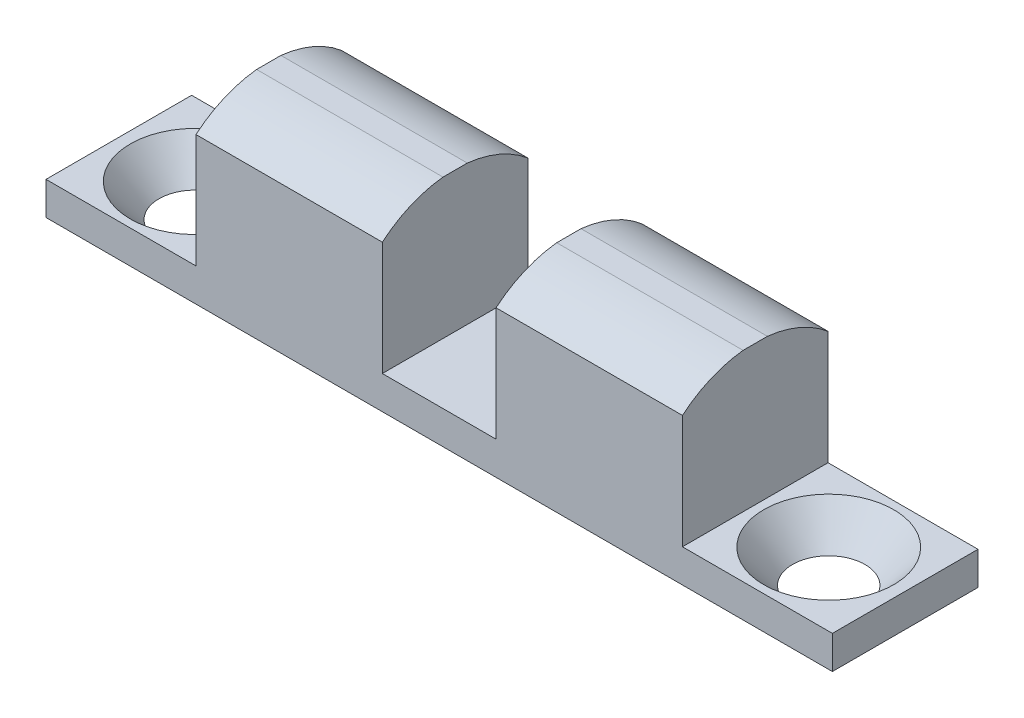
ISO-10303-21;
HEADER;
FILE_DESCRIPTION(('STEP AP214'),'2;1');
FILE_NAME('part.step','',(''),(''),'','','');
FILE_SCHEMA(('AUTOMOTIVE_DESIGN { 1 0 10303 214 1 1 1 1 }'));
ENDSEC;
DATA;
#1=APPLICATION_CONTEXT('core data for automotive mechanical design processes');
#2=APPLICATION_PROTOCOL_DEFINITION('international standard','automotive_design',2000,#1);
#3=PRODUCT_CONTEXT('',#1,'mechanical');
#4=PRODUCT('Part','Part','',(#3));
#5=PRODUCT_RELATED_PRODUCT_CATEGORY('part','',(#4));
#6=PRODUCT_DEFINITION_FORMATION('','',#4);
#7=PRODUCT_DEFINITION_CONTEXT('part definition',#1,'design');
#8=PRODUCT_DEFINITION('design','',#6,#7);
#9=PRODUCT_DEFINITION_SHAPE('','',#8);
#10=(LENGTH_UNIT() NAMED_UNIT(*) SI_UNIT(.MILLI.,.METRE.));
#11=(NAMED_UNIT(*) PLANE_ANGLE_UNIT() SI_UNIT($,.RADIAN.));
#12=(NAMED_UNIT(*) SI_UNIT($,.STERADIAN.) SOLID_ANGLE_UNIT());
#13=UNCERTAINTY_MEASURE_WITH_UNIT(LENGTH_MEASURE(1.E-05),#10,'distance_accuracy_value','');
#14=(GEOMETRIC_REPRESENTATION_CONTEXT(3) GLOBAL_UNCERTAINTY_ASSIGNED_CONTEXT((#13)) GLOBAL_UNIT_ASSIGNED_CONTEXT((#10,
#11,#12)) REPRESENTATION_CONTEXT('',''));
#15=CARTESIAN_POINT('',(0.,0.,0.));
#16=DIRECTION('',(0.,0.,1.));
#17=DIRECTION('',(1.,0.,0.));
#18=AXIS2_PLACEMENT_3D('',#15,#16,#17);
#19=CARTESIAN_POINT('',(-43.155665376832,1.8034,15.2883298868598));
#20=DIRECTION('',(0.,1.,0.));
#21=DIRECTION('',(0.,0.,1.));
#22=AXIS2_PLACEMENT_3D('',#19,#20,#21);
#23=PLANE('',#22);
#24=DIRECTION('',(1.,0.,0.));
#25=VECTOR('',#24,1.);
#26=CARTESIAN_POINT('',(-43.155665376832,1.8034,15.2883298868598));
#27=LINE('',#26,#25);
#28=CARTESIAN_POINT('',(-24.823215376832,1.8034,15.2883298868598));
#29=VERTEX_POINT('',#28);
#30=CARTESIAN_POINT('',(-18.625615376832,1.8034,15.2883298868598));
#31=VERTEX_POINT('',#30);
#32=EDGE_CURVE('E226',#29,#31,#27,.T.);
#33=ORIENTED_EDGE('',*,*,#32,.T.);
#34=DIRECTION('',(0.,0.,1.));
#35=VECTOR('',#34,1.);
#36=CARTESIAN_POINT('',(-18.625615376832,1.8034,7.35082988685977));
#37=LINE('',#36,#35);
#38=CARTESIAN_POINT('',(-18.625615376832,1.8034,7.35082988685977));
#39=VERTEX_POINT('',#38);
#40=EDGE_CURVE('E310',#39,#31,#37,.T.);
#41=ORIENTED_EDGE('',*,*,#40,.F.);
#42=DIRECTION('',(-1.,0.,0.));
#43=VECTOR('',#42,1.);
#44=CARTESIAN_POINT('',(-43.155665376832,1.8034,7.35082988685977));
#45=LINE('',#44,#43);
#46=CARTESIAN_POINT('',(-24.823215376832,1.8034,7.35082988685977));
#47=VERTEX_POINT('',#46);
#48=EDGE_CURVE('E213',#39,#47,#45,.T.);
#49=ORIENTED_EDGE('',*,*,#48,.T.);
#50=DIRECTION('',(0.,0.,-1.));
#51=VECTOR('',#50,1.);
#52=CARTESIAN_POINT('',(-24.823215376832,1.8034,7.35082988685977));
#53=LINE('',#52,#51);
#54=EDGE_CURVE('E188',#29,#47,#53,.T.);
#55=ORIENTED_EDGE('',*,*,#54,.F.);
#56=EDGE_LOOP('',(#33,#41,#49,#55));
#57=FACE_BOUND('',#56,.T.);
#58=ADVANCED_FACE('F32',(#57),#23,.T.);
#59=CARTESIAN_POINT('',(-4.46035287683199,1.8034,11.3195798868598));
#60=DIRECTION('',(0.,1.,0.));
#61=DIRECTION('',(0.,0.,1.));
#62=AXIS2_PLACEMENT_3D('',#59,#60,#61);
#63=CIRCLE('',#62,3.5433);
#64=CARTESIAN_POINT('',(-4.46035287683199,1.8034,14.8628798868598));
#65=VERTEX_POINT('',#64);
#66=EDGE_CURVE('E343',#65,#65,#63,.T.);
#67=ORIENTED_EDGE('',*,*,#66,.F.);
#68=EDGE_LOOP('',(#67));
#69=FACE_BOUND('',#68,.T.);
#70=CARTESIAN_POINT('',(-0.293165376831994,1.8034,7.35082988685977));
#71=VERTEX_POINT('',#70);
#72=CARTESIAN_POINT('',(-8.46561537683199,1.8034,7.35082988685977));
#73=VERTEX_POINT('',#72);
#74=EDGE_CURVE('E215',#71,#73,#45,.T.);
#75=ORIENTED_EDGE('',*,*,#74,.T.);
#76=DIRECTION('',(0.,0.,-1.));
#77=VECTOR('',#76,1.);
#78=CARTESIAN_POINT('',(-8.46561537683199,1.8034,7.35082988685977));
#79=LINE('',#78,#77);
#80=CARTESIAN_POINT('',(-8.46561537683199,1.8034,15.2883298868598));
#81=VERTEX_POINT('',#80);
#82=EDGE_CURVE('E273',#81,#73,#79,.T.);
#83=ORIENTED_EDGE('',*,*,#82,.F.);
#84=CARTESIAN_POINT('',(-0.293165376831994,1.8034,15.2883298868598));
#85=VERTEX_POINT('',#84);
#86=EDGE_CURVE('E216',#81,#85,#27,.T.);
#87=ORIENTED_EDGE('',*,*,#86,.T.);
#88=DIRECTION('',(0.,0.,-1.));
#89=VECTOR('',#88,1.);
#90=CARTESIAN_POINT('',(-0.293165376831994,1.8034,7.35082988685977));
#91=LINE('',#90,#89);
#92=EDGE_CURVE('E219',#85,#71,#91,.T.);
#93=ORIENTED_EDGE('',*,*,#92,.T.);
#94=EDGE_LOOP('',(#75,#83,#87,#93));
#95=FACE_BOUND('',#94,.T.);
#96=ADVANCED_FACE('F271',(#69,#95),#23,.T.);
#97=CARTESIAN_POINT('',(-38.988477876832,1.8034,11.3204057902957));
#98=DIRECTION('',(0.,1.,0.));
#99=DIRECTION('',(0.,0.,1.));
#100=AXIS2_PLACEMENT_3D('',#97,#98,#99);
#101=CIRCLE('',#100,3.5433);
#102=CARTESIAN_POINT('',(-38.988477876832,1.8034,14.8637057902957));
#103=VERTEX_POINT('',#102);
#104=EDGE_CURVE('E340',#103,#103,#101,.T.);
#105=ORIENTED_EDGE('',*,*,#104,.F.);
#106=EDGE_LOOP('',(#105));
#107=FACE_BOUND('',#106,.T.);
#108=DIRECTION('',(0.,0.,1.));
#109=VECTOR('',#108,1.);
#110=CARTESIAN_POINT('',(-34.983215376832,1.8034,7.35082988685977));
#111=LINE('',#110,#109);
#112=CARTESIAN_POINT('',(-34.983215376832,1.8034,7.35082988685977));
#113=VERTEX_POINT('',#112);
#114=CARTESIAN_POINT('',(-34.983215376832,1.8034,15.2883298868598));
#115=VERTEX_POINT('',#114);
#116=EDGE_CURVE('E169',#113,#115,#111,.T.);
#117=ORIENTED_EDGE('',*,*,#116,.F.);
#118=CARTESIAN_POINT('',(-43.155665376832,1.8034,7.35082988685977));
#119=VERTEX_POINT('',#118);
#120=EDGE_CURVE('E205',#113,#119,#45,.T.);
#121=ORIENTED_EDGE('',*,*,#120,.T.);
#122=DIRECTION('',(0.,0.,1.));
#123=VECTOR('',#122,1.);
#124=CARTESIAN_POINT('',(-43.155665376832,1.8034,7.35082988685977));
#125=LINE('',#124,#123);
#126=CARTESIAN_POINT('',(-43.155665376832,1.8034,15.2883298868598));
#127=VERTEX_POINT('',#126);
#128=EDGE_CURVE('E199',#119,#127,#125,.T.);
#129=ORIENTED_EDGE('',*,*,#128,.T.);
#130=EDGE_CURVE('E229',#127,#115,#27,.T.);
#131=ORIENTED_EDGE('',*,*,#130,.T.);
#132=EDGE_LOOP('',(#117,#121,#129,#131));
#133=FACE_BOUND('',#132,.T.);
#134=ADVANCED_FACE('F291',(#107,#133),#23,.T.);
#135=CARTESIAN_POINT('',(-43.155665376832,1.8034,7.35082988685977));
#136=DIRECTION('',(1.,0.,0.));
#137=DIRECTION('',(0.,0.,-1.));
#138=AXIS2_PLACEMENT_3D('',#135,#136,#137);
#139=PLANE('',#138);
#140=DIRECTION('',(0.,0.,1.));
#141=VECTOR('',#140,1.);
#142=CARTESIAN_POINT('',(-43.155665376832,0.,7.35082988685977));
#143=LINE('',#142,#141);
#144=CARTESIAN_POINT('',(-43.155665376832,0.,7.35082988685977));
#145=VERTEX_POINT('',#144);
#146=CARTESIAN_POINT('',(-43.155665376832,0.,15.2883298868598));
#147=VERTEX_POINT('',#146);
#148=EDGE_CURVE('E170',#145,#147,#143,.T.);
#149=ORIENTED_EDGE('',*,*,#148,.T.);
#150=DIRECTION('',(0.,-1.,0.));
#151=VECTOR('',#150,1.);
#152=CARTESIAN_POINT('',(-43.155665376832,1.8034,15.2883298868598));
#153=LINE('',#152,#151);
#154=EDGE_CURVE('E212',#127,#147,#153,.T.);
#155=ORIENTED_EDGE('',*,*,#154,.F.);
#156=ORIENTED_EDGE('',*,*,#128,.F.);
#157=DIRECTION('',(0.,-1.,0.));
#158=VECTOR('',#157,1.);
#159=CARTESIAN_POINT('',(-43.155665376832,1.8034,7.35082988685977));
#160=LINE('',#159,#158);
#161=EDGE_CURVE('E225',#119,#145,#160,.T.);
#162=ORIENTED_EDGE('',*,*,#161,.T.);
#163=EDGE_LOOP('',(#149,#155,#156,#162));
#164=FACE_BOUND('',#163,.T.);
#165=ADVANCED_FACE('F34',(#164),#139,.F.);
#166=CARTESIAN_POINT('',(-43.155665376832,1.8034,15.2883298868598));
#167=DIRECTION('',(0.,0.,-1.));
#168=DIRECTION('',(-1.,0.,0.));
#169=AXIS2_PLACEMENT_3D('',#166,#167,#168);
#170=PLANE('',#169);
#171=DIRECTION('',(0.,-1.,0.));
#172=VECTOR('',#171,1.);
#173=CARTESIAN_POINT('',(-8.46561537683199,9.4234,15.2883298868598));
#174=LINE('',#173,#172);
#175=CARTESIAN_POINT('',(-8.46561537683199,8.00573745703919,15.2883298868598));
#176=VERTEX_POINT('',#175);
#177=EDGE_CURVE('E275',#176,#81,#174,.T.);
#178=ORIENTED_EDGE('',*,*,#177,.F.);
#179=DIRECTION('',(-1.,0.,0.));
#180=VECTOR('',#179,1.);
#181=CARTESIAN_POINT('',(-0.293165376831994,8.00573745703919,15.2883298868598));
#182=LINE('',#181,#180);
#183=CARTESIAN_POINT('',(-18.625615376832,8.00573745703919,15.2883298868598));
#184=VERTEX_POINT('',#183);
#185=EDGE_CURVE('E164',#176,#184,#182,.T.);
#186=ORIENTED_EDGE('',*,*,#185,.T.);
#187=DIRECTION('',(0.,-1.,0.));
#188=VECTOR('',#187,1.);
#189=CARTESIAN_POINT('',(-18.625615376832,9.4234,15.2883298868598));
#190=LINE('',#189,#188);
#191=EDGE_CURVE('E279',#184,#31,#190,.T.);
#192=ORIENTED_EDGE('',*,*,#191,.T.);
#193=ORIENTED_EDGE('',*,*,#32,.F.);
#194=DIRECTION('',(0.,-1.,0.));
#195=VECTOR('',#194,1.);
#196=CARTESIAN_POINT('',(-24.823215376832,9.4234,15.2883298868598));
#197=LINE('',#196,#195);
#198=CARTESIAN_POINT('',(-24.823215376832,8.00573745703919,15.2883298868598));
#199=VERTEX_POINT('',#198);
#200=EDGE_CURVE('E163',#199,#29,#197,.T.);
#201=ORIENTED_EDGE('',*,*,#200,.F.);
#202=CARTESIAN_POINT('',(-34.983215376832,8.00573745703919,15.2883298868598));
#203=VERTEX_POINT('',#202);
#204=EDGE_CURVE('E148',#199,#203,#182,.T.);
#205=ORIENTED_EDGE('',*,*,#204,.T.);
#206=DIRECTION('',(0.,-1.,0.));
#207=VECTOR('',#206,1.);
#208=CARTESIAN_POINT('',(-34.983215376832,9.4234,15.2883298868598));
#209=LINE('',#208,#207);
#210=EDGE_CURVE('E160',#203,#115,#209,.T.);
#211=ORIENTED_EDGE('',*,*,#210,.T.);
#212=ORIENTED_EDGE('',*,*,#130,.F.);
#213=ORIENTED_EDGE('',*,*,#154,.T.);
#214=DIRECTION('',(1.,0.,0.));
#215=VECTOR('',#214,1.);
#216=CARTESIAN_POINT('',(-43.155665376832,0.,15.2883298868598));
#217=LINE('',#216,#215);
#218=CARTESIAN_POINT('',(-0.293165376831994,0.,15.2883298868598));
#219=VERTEX_POINT('',#218);
#220=EDGE_CURVE('E173',#147,#219,#217,.T.);
#221=ORIENTED_EDGE('',*,*,#220,.T.);
#222=DIRECTION('',(0.,-1.,0.));
#223=VECTOR('',#222,1.);
#224=CARTESIAN_POINT('',(-0.293165376831994,1.8034,15.2883298868598));
#225=LINE('',#224,#223);
#226=EDGE_CURVE('E236',#85,#219,#225,.T.);
#227=ORIENTED_EDGE('',*,*,#226,.F.);
#228=ORIENTED_EDGE('',*,*,#86,.F.);
#229=EDGE_LOOP('',(#178,#186,#192,#193,#201,#205,#211,#212,#213,#221,#227,#228));
#230=FACE_BOUND('',#229,.T.);
#231=ADVANCED_FACE('F159',(#230),#170,.F.);
#232=CARTESIAN_POINT('',(-0.293165376831994,1.8034,7.35082988685977));
#233=DIRECTION('',(-1.,0.,0.));
#234=DIRECTION('',(0.,0.,1.));
#235=AXIS2_PLACEMENT_3D('',#232,#233,#234);
#236=PLANE('',#235);
#237=DIRECTION('',(0.,0.,-1.));
#238=VECTOR('',#237,1.);
#239=CARTESIAN_POINT('',(-0.293165376831994,0.,7.35082988685977));
#240=LINE('',#239,#238);
#241=CARTESIAN_POINT('',(-0.293165376831994,0.,7.35082988685977));
#242=VERTEX_POINT('',#241);
#243=EDGE_CURVE('E246',#219,#242,#240,.T.);
#244=ORIENTED_EDGE('',*,*,#243,.T.);
#245=DIRECTION('',(0.,-1.,0.));
#246=VECTOR('',#245,1.);
#247=CARTESIAN_POINT('',(-0.293165376831994,1.8034,7.35082988685977));
#248=LINE('',#247,#246);
#249=EDGE_CURVE('E239',#71,#242,#248,.T.);
#250=ORIENTED_EDGE('',*,*,#249,.F.);
#251=ORIENTED_EDGE('',*,*,#92,.F.);
#252=ORIENTED_EDGE('',*,*,#226,.T.);
#253=EDGE_LOOP('',(#244,#250,#251,#252));
#254=FACE_BOUND('',#253,.T.);
#255=ADVANCED_FACE('F255',(#254),#236,.F.);
#256=CARTESIAN_POINT('',(-43.155665376832,1.8034,7.35082988685977));
#257=DIRECTION('',(0.,0.,1.));
#258=DIRECTION('',(1.,0.,0.));
#259=AXIS2_PLACEMENT_3D('',#256,#257,#258);
#260=PLANE('',#259);
#261=DIRECTION('',(0.,-1.,0.));
#262=VECTOR('',#261,1.);
#263=CARTESIAN_POINT('',(-34.983215376832,9.4234,7.35082988685977));
#264=LINE('',#263,#262);
#265=CARTESIAN_POINT('',(-34.983215376832,8.00573745703919,7.35082988685977));
#266=VERTEX_POINT('',#265);
#267=EDGE_CURVE('E181',#266,#113,#264,.T.);
#268=ORIENTED_EDGE('',*,*,#267,.F.);
#269=DIRECTION('',(-1.,0.,0.));
#270=VECTOR('',#269,1.);
#271=CARTESIAN_POINT('',(-0.293165376831994,8.00573745703919,7.35082988685977));
#272=LINE('',#271,#270);
#273=CARTESIAN_POINT('',(-24.823215376832,8.00573745703919,7.35082988685977));
#274=VERTEX_POINT('',#273);
#275=EDGE_CURVE('E338',#274,#266,#272,.T.);
#276=ORIENTED_EDGE('',*,*,#275,.F.);
#277=DIRECTION('',(0.,-1.,0.));
#278=VECTOR('',#277,1.);
#279=CARTESIAN_POINT('',(-24.823215376832,9.4234,7.35082988685977));
#280=LINE('',#279,#278);
#281=EDGE_CURVE('E175',#274,#47,#280,.T.);
#282=ORIENTED_EDGE('',*,*,#281,.T.);
#283=ORIENTED_EDGE('',*,*,#48,.F.);
#284=DIRECTION('',(0.,-1.,0.));
#285=VECTOR('',#284,1.);
#286=CARTESIAN_POINT('',(-18.625615376832,9.4234,7.35082988685977));
#287=LINE('',#286,#285);
#288=CARTESIAN_POINT('',(-18.625615376832,8.00573745703919,7.35082988685977));
#289=VERTEX_POINT('',#288);
#290=EDGE_CURVE('E189',#289,#39,#287,.T.);
#291=ORIENTED_EDGE('',*,*,#290,.F.);
#292=CARTESIAN_POINT('',(-8.46561537683199,8.00573745703919,7.35082988685977));
#293=VERTEX_POINT('',#292);
#294=EDGE_CURVE('E336',#293,#289,#272,.T.);
#295=ORIENTED_EDGE('',*,*,#294,.F.);
#296=DIRECTION('',(0.,-1.,0.));
#297=VECTOR('',#296,1.);
#298=CARTESIAN_POINT('',(-8.46561537683199,9.4234,7.35082988685977));
#299=LINE('',#298,#297);
#300=EDGE_CURVE('E280',#293,#73,#299,.T.);
#301=ORIENTED_EDGE('',*,*,#300,.T.);
#302=ORIENTED_EDGE('',*,*,#74,.F.);
#303=ORIENTED_EDGE('',*,*,#249,.T.);
#304=DIRECTION('',(-1.,0.,0.));
#305=VECTOR('',#304,1.);
#306=CARTESIAN_POINT('',(-43.155665376832,0.,7.35082988685977));
#307=LINE('',#306,#305);
#308=EDGE_CURVE('E244',#242,#145,#307,.T.);
#309=ORIENTED_EDGE('',*,*,#308,.T.);
#310=ORIENTED_EDGE('',*,*,#161,.F.);
#311=ORIENTED_EDGE('',*,*,#120,.F.);
#312=EDGE_LOOP('',(#268,#276,#282,#283,#291,#295,#301,#302,#303,#309,#310,#311));
#313=FACE_BOUND('',#312,.T.);
#314=ADVANCED_FACE('F262',(#313),#260,.F.);
#315=CARTESIAN_POINT('',(-43.155665376832,0.,15.2883298868598));
#316=DIRECTION('',(0.,1.,0.));
#317=DIRECTION('',(0.,0.,1.));
#318=AXIS2_PLACEMENT_3D('',#315,#316,#317);
#319=PLANE('',#318);
#320=CARTESIAN_POINT('',(-4.46035287683199,0.,11.3195798868598));
#321=DIRECTION('',(0.,1.,0.));
#322=DIRECTION('',(0.,0.,1.));
#323=AXIS2_PLACEMENT_3D('',#320,#321,#322);
#324=CIRCLE('',#323,1.97562829702222);
#325=CARTESIAN_POINT('',(-4.46035287683199,0.,13.295208183882));
#326=VERTEX_POINT('',#325);
#327=EDGE_CURVE('E36',#326,#326,#324,.T.);
#328=ORIENTED_EDGE('',*,*,#327,.T.);
#329=EDGE_LOOP('',(#328));
#330=FACE_BOUND('',#329,.T.);
#331=CARTESIAN_POINT('',(-38.988477876832,0.,11.3204057902957));
#332=DIRECTION('',(0.,1.,0.));
#333=DIRECTION('',(0.,0.,1.));
#334=AXIS2_PLACEMENT_3D('',#331,#332,#333);
#335=CIRCLE('',#334,1.97562829702222);
#336=CARTESIAN_POINT('',(-38.988477876832,0.,13.2960340873179));
#337=VERTEX_POINT('',#336);
#338=EDGE_CURVE('E154',#337,#337,#335,.T.);
#339=ORIENTED_EDGE('',*,*,#338,.T.);
#340=EDGE_LOOP('',(#339));
#341=FACE_BOUND('',#340,.T.);
#342=ORIENTED_EDGE('',*,*,#148,.F.);
#343=ORIENTED_EDGE('',*,*,#308,.F.);
#344=ORIENTED_EDGE('',*,*,#243,.F.);
#345=ORIENTED_EDGE('',*,*,#220,.F.);
#346=EDGE_LOOP('',(#342,#343,#344,#345));
#347=FACE_BOUND('',#346,.T.);
#348=ADVANCED_FACE('F258',(#330,#341,#347),#319,.F.);
#349=CARTESIAN_POINT('',(-34.983215376832,9.4234,7.35082988685977));
#350=DIRECTION('',(1.,0.,0.));
#351=DIRECTION('',(0.,0.,-1.));
#352=AXIS2_PLACEMENT_3D('',#349,#350,#351);
#353=PLANE('',#352);
#354=ORIENTED_EDGE('',*,*,#210,.F.);
#355=CARTESIAN_POINT('',(-34.983215376832,3.31412883260953,11.3195798868598));
#356=DIRECTION('',(1.,0.,0.));
#357=DIRECTION('',(0.,0.,-1.));
#358=AXIS2_PLACEMENT_3D('',#355,#356,#357);
#359=CIRCLE('',#358,6.14509300558769);
#360=CARTESIAN_POINT('',(-34.983215376832,9.4234,11.9821309042269));
#361=VERTEX_POINT('',#360);
#362=EDGE_CURVE('E145',#361,#203,#359,.T.);
#363=ORIENTED_EDGE('',*,*,#362,.F.);
#364=DIRECTION('',(0.,0.,1.));
#365=VECTOR('',#364,1.);
#366=CARTESIAN_POINT('',(-34.983215376832,9.4234,7.35082988685977));
#367=LINE('',#366,#365);
#368=CARTESIAN_POINT('',(-34.983215376832,9.4234,10.6570288694926));
#369=VERTEX_POINT('',#368);
#370=EDGE_CURVE('E204',#369,#361,#367,.T.);
#371=ORIENTED_EDGE('',*,*,#370,.F.);
#372=EDGE_CURVE('E57',#266,#369,#359,.T.);
#373=ORIENTED_EDGE('',*,*,#372,.F.);
#374=ORIENTED_EDGE('',*,*,#267,.T.);
#375=ORIENTED_EDGE('',*,*,#116,.T.);
#376=EDGE_LOOP('',(#354,#363,#371,#373,#374,#375));
#377=FACE_BOUND('',#376,.T.);
#378=ADVANCED_FACE('F167',(#377),#353,.F.);
#379=CARTESIAN_POINT('',(-24.823215376832,9.4234,7.35082988685977));
#380=DIRECTION('',(-1.,0.,0.));
#381=DIRECTION('',(0.,0.,1.));
#382=AXIS2_PLACEMENT_3D('',#379,#380,#381);
#383=PLANE('',#382);
#384=ORIENTED_EDGE('',*,*,#281,.F.);
#385=CARTESIAN_POINT('',(-24.823215376832,3.31412883260953,11.3195798868598));
#386=DIRECTION('',(-1.,0.,0.));
#387=DIRECTION('',(0.,0.,1.));
#388=AXIS2_PLACEMENT_3D('',#385,#386,#387);
#389=CIRCLE('',#388,6.14509300558769);
#390=CARTESIAN_POINT('',(-24.823215376832,9.4234,10.6570288694926));
#391=VERTEX_POINT('',#390);
#392=EDGE_CURVE('E317',#274,#391,#389,.F.);
#393=ORIENTED_EDGE('',*,*,#392,.T.);
#394=DIRECTION('',(0.,0.,-1.));
#395=VECTOR('',#394,1.);
#396=CARTESIAN_POINT('',(-24.823215376832,9.4234,7.35082988685977));
#397=LINE('',#396,#395);
#398=CARTESIAN_POINT('',(-24.823215376832,9.4234,11.9821309042269));
#399=VERTEX_POINT('',#398);
#400=EDGE_CURVE('E195',#399,#391,#397,.T.);
#401=ORIENTED_EDGE('',*,*,#400,.F.);
#402=EDGE_CURVE('E49',#399,#199,#389,.F.);
#403=ORIENTED_EDGE('',*,*,#402,.T.);
#404=ORIENTED_EDGE('',*,*,#200,.T.);
#405=ORIENTED_EDGE('',*,*,#54,.T.);
#406=EDGE_LOOP('',(#384,#393,#401,#403,#404,#405));
#407=FACE_BOUND('',#406,.T.);
#408=ADVANCED_FACE('F378',(#407),#383,.F.);
#409=CARTESIAN_POINT('',(-34.983215376832,9.4234,15.2883298868598));
#410=DIRECTION('',(0.,1.,0.));
#411=DIRECTION('',(0.,0.,1.));
#412=AXIS2_PLACEMENT_3D('',#409,#410,#411);
#413=PLANE('',#412);
#414=DIRECTION('',(-1.,0.,0.));
#415=VECTOR('',#414,1.);
#416=CARTESIAN_POINT('',(-0.293165376831994,9.4234,10.6570288694926));
#417=LINE('',#416,#415);
#418=EDGE_CURVE('E321',#369,#391,#417,.F.);
#419=ORIENTED_EDGE('',*,*,#418,.F.);
#420=ORIENTED_EDGE('',*,*,#370,.T.);
#421=DIRECTION('',(-1.,0.,0.));
#422=VECTOR('',#421,1.);
#423=CARTESIAN_POINT('',(-0.293165376831994,9.4234,11.9821309042269));
#424=LINE('',#423,#422);
#425=EDGE_CURVE('E149',#399,#361,#424,.T.);
#426=ORIENTED_EDGE('',*,*,#425,.F.);
#427=ORIENTED_EDGE('',*,*,#400,.T.);
#428=EDGE_LOOP('',(#419,#420,#426,#427));
#429=FACE_BOUND('',#428,.T.);
#430=ADVANCED_FACE('F375',(#429),#413,.T.);
#431=CARTESIAN_POINT('',(-18.625615376832,9.4234,7.35082988685977));
#432=DIRECTION('',(1.,0.,0.));
#433=DIRECTION('',(0.,0.,-1.));
#434=AXIS2_PLACEMENT_3D('',#431,#432,#433);
#435=PLANE('',#434);
#436=ORIENTED_EDGE('',*,*,#191,.F.);
#437=CARTESIAN_POINT('',(-18.625615376832,3.31412883260953,11.3195798868598));
#438=DIRECTION('',(1.,0.,0.));
#439=DIRECTION('',(0.,0.,-1.));
#440=AXIS2_PLACEMENT_3D('',#437,#438,#439);
#441=CIRCLE('',#440,6.14509300558769);
#442=CARTESIAN_POINT('',(-18.625615376832,9.4234,11.9821309042269));
#443=VERTEX_POINT('',#442);
#444=EDGE_CURVE('E330',#184,#443,#441,.F.);
#445=ORIENTED_EDGE('',*,*,#444,.T.);
#446=DIRECTION('',(0.,0.,1.));
#447=VECTOR('',#446,1.);
#448=CARTESIAN_POINT('',(-18.625615376832,9.4234,7.35082988685977));
#449=LINE('',#448,#447);
#450=CARTESIAN_POINT('',(-18.625615376832,9.4234,10.6570288694926));
#451=VERTEX_POINT('',#450);
#452=EDGE_CURVE('E319',#451,#443,#449,.T.);
#453=ORIENTED_EDGE('',*,*,#452,.F.);
#454=EDGE_CURVE('E331',#451,#289,#441,.F.);
#455=ORIENTED_EDGE('',*,*,#454,.T.);
#456=ORIENTED_EDGE('',*,*,#290,.T.);
#457=ORIENTED_EDGE('',*,*,#40,.T.);
#458=EDGE_LOOP('',(#436,#445,#453,#455,#456,#457));
#459=FACE_BOUND('',#458,.T.);
#460=ADVANCED_FACE('F314',(#459),#435,.F.);
#461=CARTESIAN_POINT('',(-8.46561537683199,9.4234,7.35082988685977));
#462=DIRECTION('',(-1.,0.,0.));
#463=DIRECTION('',(0.,0.,1.));
#464=AXIS2_PLACEMENT_3D('',#461,#462,#463);
#465=PLANE('',#464);
#466=ORIENTED_EDGE('',*,*,#300,.F.);
#467=CARTESIAN_POINT('',(-8.46561537683199,3.31412883260953,11.3195798868598));
#468=DIRECTION('',(-1.,0.,0.));
#469=DIRECTION('',(0.,0.,1.));
#470=AXIS2_PLACEMENT_3D('',#467,#468,#469);
#471=CIRCLE('',#470,6.14509300558769);
#472=CARTESIAN_POINT('',(-8.46561537683199,9.4234,10.6570288694926));
#473=VERTEX_POINT('',#472);
#474=EDGE_CURVE('E334',#293,#473,#471,.F.);
#475=ORIENTED_EDGE('',*,*,#474,.T.);
#476=DIRECTION('',(0.,0.,-1.));
#477=VECTOR('',#476,1.);
#478=CARTESIAN_POINT('',(-8.46561537683199,9.4234,7.35082988685977));
#479=LINE('',#478,#477);
#480=CARTESIAN_POINT('',(-8.46561537683199,9.4234,11.9821309042269));
#481=VERTEX_POINT('',#480);
#482=EDGE_CURVE('E283',#481,#473,#479,.T.);
#483=ORIENTED_EDGE('',*,*,#482,.F.);
#484=EDGE_CURVE('E333',#481,#176,#471,.F.);
#485=ORIENTED_EDGE('',*,*,#484,.T.);
#486=ORIENTED_EDGE('',*,*,#177,.T.);
#487=ORIENTED_EDGE('',*,*,#82,.T.);
#488=EDGE_LOOP('',(#466,#475,#483,#485,#486,#487));
#489=FACE_BOUND('',#488,.T.);
#490=ADVANCED_FACE('F369',(#489),#465,.F.);
#491=CARTESIAN_POINT('',(-8.46561537683199,9.4234,7.35082988685977));
#492=DIRECTION('',(0.,-1.,0.));
#493=DIRECTION('',(0.,0.,-1.));
#494=AXIS2_PLACEMENT_3D('',#491,#492,#493);
#495=PLANE('',#494);
#496=ORIENTED_EDGE('',*,*,#452,.T.);
#497=DIRECTION('',(-1.,0.,0.));
#498=VECTOR('',#497,1.);
#499=CARTESIAN_POINT('',(-0.293165376831994,9.4234,11.9821309042269));
#500=LINE('',#499,#498);
#501=EDGE_CURVE('E11',#443,#481,#500,.F.);
#502=ORIENTED_EDGE('',*,*,#501,.T.);
#503=ORIENTED_EDGE('',*,*,#482,.T.);
#504=DIRECTION('',(-1.,0.,0.));
#505=VECTOR('',#504,1.);
#506=CARTESIAN_POINT('',(-0.293165376831994,9.4234,10.6570288694926));
#507=LINE('',#506,#505);
#508=EDGE_CURVE('E41',#473,#451,#507,.T.);
#509=ORIENTED_EDGE('',*,*,#508,.T.);
#510=EDGE_LOOP('',(#496,#502,#503,#509));
#511=FACE_BOUND('',#510,.T.);
#512=ADVANCED_FACE('F366',(#511),#495,.F.);
#513=CARTESIAN_POINT('',(-0.293165376831994,3.31412883260953,11.3195798868598));
#514=DIRECTION('',(-1.,0.,0.));
#515=DIRECTION('',(0.,0.,1.));
#516=AXIS2_PLACEMENT_3D('',#513,#514,#515);
#517=CYLINDRICAL_SURFACE('',#516,6.14509300558769);
#518=ORIENTED_EDGE('',*,*,#508,.F.);
#519=ORIENTED_EDGE('',*,*,#474,.F.);
#520=ORIENTED_EDGE('',*,*,#294,.T.);
#521=ORIENTED_EDGE('',*,*,#454,.F.);
#522=EDGE_LOOP('',(#518,#519,#520,#521));
#523=FACE_BOUND('',#522,.T.);
#524=ADVANCED_FACE('F365',(#523),#517,.T.);
#525=ORIENTED_EDGE('',*,*,#185,.F.);
#526=ORIENTED_EDGE('',*,*,#484,.F.);
#527=ORIENTED_EDGE('',*,*,#501,.F.);
#528=ORIENTED_EDGE('',*,*,#444,.F.);
#529=EDGE_LOOP('',(#525,#526,#527,#528));
#530=FACE_BOUND('',#529,.T.);
#531=ADVANCED_FACE('F448',(#530),#517,.T.);
#532=ORIENTED_EDGE('',*,*,#425,.T.);
#533=ORIENTED_EDGE('',*,*,#362,.T.);
#534=ORIENTED_EDGE('',*,*,#204,.F.);
#535=ORIENTED_EDGE('',*,*,#402,.F.);
#536=EDGE_LOOP('',(#532,#533,#534,#535));
#537=FACE_BOUND('',#536,.T.);
#538=ADVANCED_FACE('F147',(#537),#517,.T.);
#539=ORIENTED_EDGE('',*,*,#275,.T.);
#540=ORIENTED_EDGE('',*,*,#372,.T.);
#541=ORIENTED_EDGE('',*,*,#418,.T.);
#542=ORIENTED_EDGE('',*,*,#392,.F.);
#543=EDGE_LOOP('',(#539,#540,#541,#542));
#544=FACE_BOUND('',#543,.T.);
#545=ADVANCED_FACE('F359',(#544),#517,.T.);
#546=CARTESIAN_POINT('',(-38.988477876832,1.8034,11.3204057902957));
#547=DIRECTION('',(0.,1.,0.));
#548=DIRECTION('',(0.,0.,1.));
#549=AXIS2_PLACEMENT_3D('',#546,#547,#548);
#550=CONICAL_SURFACE('',#549,3.5433,0.715584993317674);
#551=ORIENTED_EDGE('',*,*,#104,.T.);
#552=EDGE_LOOP('',(#551));
#553=FACE_BOUND('',#552,.T.);
#554=ORIENTED_EDGE('',*,*,#338,.F.);
#555=EDGE_LOOP('',(#554));
#556=FACE_BOUND('',#555,.T.);
#557=ADVANCED_FACE('F354',(#553,#556),#550,.F.);
#558=CARTESIAN_POINT('',(-4.46035287683199,1.8034,11.3195798868598));
#559=DIRECTION('',(0.,1.,0.));
#560=DIRECTION('',(0.,0.,1.));
#561=AXIS2_PLACEMENT_3D('',#558,#559,#560);
#562=CONICAL_SURFACE('',#561,3.5433,0.715584993317675);
#563=ORIENTED_EDGE('',*,*,#66,.T.);
#564=EDGE_LOOP('',(#563));
#565=FACE_BOUND('',#564,.T.);
#566=ORIENTED_EDGE('',*,*,#327,.F.);
#567=EDGE_LOOP('',(#566));
#568=FACE_BOUND('',#567,.T.);
#569=ADVANCED_FACE('F352',(#565,#568),#562,.F.);
#570=CLOSED_SHELL('',(#58,#96,#134,#165,#231,#255,#314,#348,#378,#408,#430,#460,#490,#512,#524,
#531,#538,#545,#557,#569));
#571=MANIFOLD_SOLID_BREP('B2',#570);
#572=ADVANCED_BREP_SHAPE_REPRESENTATION('',(#18,#571),#14);
#573=SHAPE_DEFINITION_REPRESENTATION(#9,#572);
ENDSEC;
END-ISO-10303-21;
